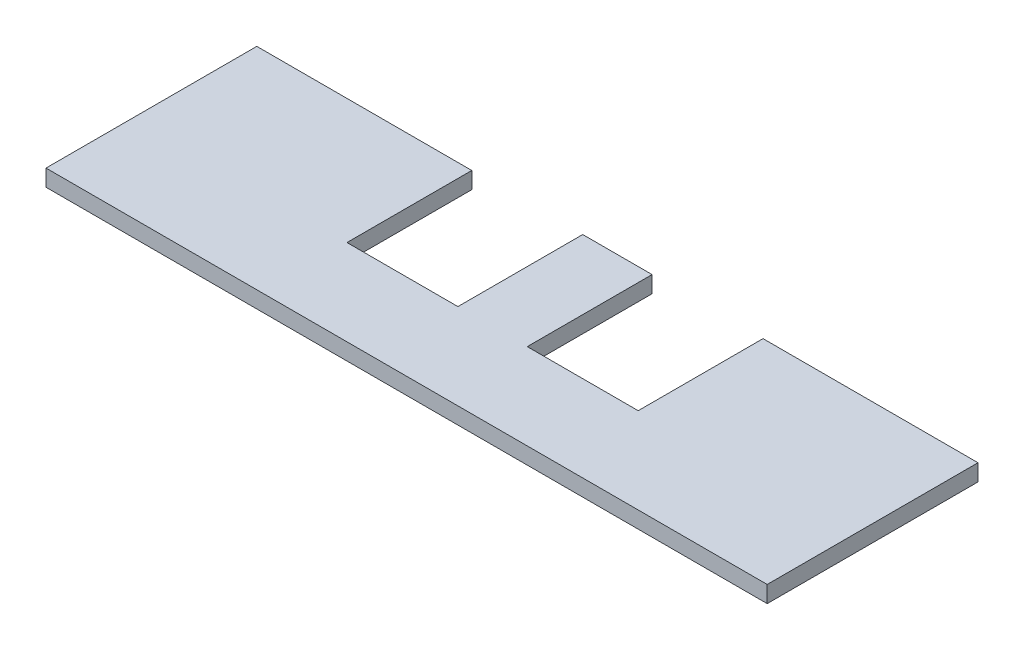
ISO-10303-21;
HEADER;
FILE_DESCRIPTION(('STEP AP214'),'2;1');
FILE_NAME('part.step','',(''),(''),'','','');
FILE_SCHEMA(('AUTOMOTIVE_DESIGN { 1 0 10303 214 1 1 1 1 }'));
ENDSEC;
DATA;
#1=APPLICATION_CONTEXT('core data for automotive mechanical design processes');
#2=APPLICATION_PROTOCOL_DEFINITION('international standard','automotive_design',2000,#1);
#3=PRODUCT_CONTEXT('',#1,'mechanical');
#4=PRODUCT('Part','Part','',(#3));
#5=PRODUCT_RELATED_PRODUCT_CATEGORY('part','',(#4));
#6=PRODUCT_DEFINITION_FORMATION('','',#4);
#7=PRODUCT_DEFINITION_CONTEXT('part definition',#1,'design');
#8=PRODUCT_DEFINITION('design','',#6,#7);
#9=PRODUCT_DEFINITION_SHAPE('','',#8);
#10=(LENGTH_UNIT() NAMED_UNIT(*) SI_UNIT(.MILLI.,.METRE.));
#11=(NAMED_UNIT(*) PLANE_ANGLE_UNIT() SI_UNIT($,.RADIAN.));
#12=(NAMED_UNIT(*) SI_UNIT($,.STERADIAN.) SOLID_ANGLE_UNIT());
#13=UNCERTAINTY_MEASURE_WITH_UNIT(LENGTH_MEASURE(1.E-05),#10,'distance_accuracy_value','');
#14=(GEOMETRIC_REPRESENTATION_CONTEXT(3) GLOBAL_UNCERTAINTY_ASSIGNED_CONTEXT((#13)) GLOBAL_UNIT_ASSIGNED_CONTEXT((#10,
#11,#12)) REPRESENTATION_CONTEXT('',''));
#15=CARTESIAN_POINT('',(0.,0.,0.));
#16=DIRECTION('',(0.,0.,1.));
#17=DIRECTION('',(1.,0.,0.));
#18=AXIS2_PLACEMENT_3D('',#15,#16,#17);
#19=CARTESIAN_POINT('',(0.,3.,0.));
#20=DIRECTION('',(0.,-1.,0.));
#21=DIRECTION('',(0.,0.,-1.));
#22=AXIS2_PLACEMENT_3D('',#19,#20,#21);
#23=PLANE('',#22);
#24=DIRECTION('',(0.,0.,-1.));
#25=VECTOR('',#24,1.);
#26=CARTESIAN_POINT('',(65.,3.,60.));
#27=LINE('',#26,#25);
#28=CARTESIAN_POINT('',(65.,3.,60.));
#29=VERTEX_POINT('',#28);
#30=CARTESIAN_POINT('',(65.,3.,22.));
#31=VERTEX_POINT('',#30);
#32=EDGE_CURVE('E146',#29,#31,#27,.T.);
#33=ORIENTED_EDGE('',*,*,#32,.T.);
#34=DIRECTION('',(-1.,0.,0.));
#35=VECTOR('',#34,1.);
#36=CARTESIAN_POINT('',(0.,3.,22.));
#37=LINE('',#36,#35);
#38=CARTESIAN_POINT('',(26.25,3.,22.));
#39=VERTEX_POINT('',#38);
#40=EDGE_CURVE('E213',#31,#39,#37,.T.);
#41=ORIENTED_EDGE('',*,*,#40,.T.);
#42=DIRECTION('',(0.,0.,-1.));
#43=VECTOR('',#42,1.);
#44=CARTESIAN_POINT('',(26.25,3.,0.));
#45=LINE('',#44,#43);
#46=CARTESIAN_POINT('',(26.25,3.,44.5));
#47=VERTEX_POINT('',#46);
#48=EDGE_CURVE('E189',#47,#39,#45,.T.);
#49=ORIENTED_EDGE('',*,*,#48,.F.);
#50=DIRECTION('',(1.,0.,0.));
#51=VECTOR('',#50,1.);
#52=CARTESIAN_POINT('',(0.,3.,44.5));
#53=LINE('',#52,#51);
#54=CARTESIAN_POINT('',(6.25,3.,44.5));
#55=VERTEX_POINT('',#54);
#56=EDGE_CURVE('E192',#55,#47,#53,.T.);
#57=ORIENTED_EDGE('',*,*,#56,.F.);
#58=DIRECTION('',(0.,0.,1.));
#59=VECTOR('',#58,1.);
#60=CARTESIAN_POINT('',(6.25,3.,0.));
#61=LINE('',#60,#59);
#62=CARTESIAN_POINT('',(6.25,3.,22.));
#63=VERTEX_POINT('',#62);
#64=EDGE_CURVE('E187',#63,#55,#61,.T.);
#65=ORIENTED_EDGE('',*,*,#64,.F.);
#66=CARTESIAN_POINT('',(-6.25,3.,22.));
#67=VERTEX_POINT('',#66);
#68=EDGE_CURVE('E56',#63,#67,#37,.T.);
#69=ORIENTED_EDGE('',*,*,#68,.T.);
#70=DIRECTION('',(0.,0.,1.));
#71=VECTOR('',#70,1.);
#72=CARTESIAN_POINT('',(-6.25,3.,0.));
#73=LINE('',#72,#71);
#74=CARTESIAN_POINT('',(-6.25,3.,44.5));
#75=VERTEX_POINT('',#74);
#76=EDGE_CURVE('E149',#67,#75,#73,.T.);
#77=ORIENTED_EDGE('',*,*,#76,.T.);
#78=DIRECTION('',(-1.,0.,0.));
#79=VECTOR('',#78,1.);
#80=CARTESIAN_POINT('',(0.,3.,44.5));
#81=LINE('',#80,#79);
#82=CARTESIAN_POINT('',(-26.25,3.,44.5));
#83=VERTEX_POINT('',#82);
#84=EDGE_CURVE('E167',#75,#83,#81,.T.);
#85=ORIENTED_EDGE('',*,*,#84,.T.);
#86=DIRECTION('',(0.,0.,-1.));
#87=VECTOR('',#86,1.);
#88=CARTESIAN_POINT('',(-26.25,3.,0.));
#89=LINE('',#88,#87);
#90=CARTESIAN_POINT('',(-26.25,3.,22.));
#91=VERTEX_POINT('',#90);
#92=EDGE_CURVE('E170',#83,#91,#89,.T.);
#93=ORIENTED_EDGE('',*,*,#92,.T.);
#94=CARTESIAN_POINT('',(-65.,3.,22.));
#95=VERTEX_POINT('',#94);
#96=EDGE_CURVE('E48',#91,#95,#37,.T.);
#97=ORIENTED_EDGE('',*,*,#96,.T.);
#98=DIRECTION('',(0.,0.,1.));
#99=VECTOR('',#98,1.);
#100=CARTESIAN_POINT('',(-65.,3.,60.));
#101=LINE('',#100,#99);
#102=CARTESIAN_POINT('',(-65.,3.,60.));
#103=VERTEX_POINT('',#102);
#104=EDGE_CURVE('E136',#95,#103,#101,.T.);
#105=ORIENTED_EDGE('',*,*,#104,.T.);
#106=DIRECTION('',(1.,0.,0.));
#107=VECTOR('',#106,1.);
#108=CARTESIAN_POINT('',(-65.,3.,60.));
#109=LINE('',#108,#107);
#110=EDGE_CURVE('E155',#103,#29,#109,.T.);
#111=ORIENTED_EDGE('',*,*,#110,.T.);
#112=EDGE_LOOP('',(#33,#41,#49,#57,#65,#69,#77,#85,#93,#97,#105,#111));
#113=FACE_BOUND('',#112,.T.);
#114=ADVANCED_FACE('F33',(#113),#23,.F.);
#115=CARTESIAN_POINT('',(0.,0.,0.));
#116=DIRECTION('',(0.,-1.,0.));
#117=DIRECTION('',(0.,0.,-1.));
#118=AXIS2_PLACEMENT_3D('',#115,#116,#117);
#119=PLANE('',#118);
#120=DIRECTION('',(1.,0.,0.));
#121=VECTOR('',#120,1.);
#122=CARTESIAN_POINT('',(-65.,0.,22.));
#123=LINE('',#122,#121);
#124=CARTESIAN_POINT('',(26.25,0.,22.));
#125=VERTEX_POINT('',#124);
#126=CARTESIAN_POINT('',(65.,0.,22.));
#127=VERTEX_POINT('',#126);
#128=EDGE_CURVE('E129',#125,#127,#123,.T.);
#129=ORIENTED_EDGE('',*,*,#128,.T.);
#130=DIRECTION('',(0.,0.,-1.));
#131=VECTOR('',#130,1.);
#132=CARTESIAN_POINT('',(65.,0.,60.));
#133=LINE('',#132,#131);
#134=CARTESIAN_POINT('',(65.,0.,60.));
#135=VERTEX_POINT('',#134);
#136=EDGE_CURVE('E144',#135,#127,#133,.T.);
#137=ORIENTED_EDGE('',*,*,#136,.F.);
#138=DIRECTION('',(1.,0.,0.));
#139=VECTOR('',#138,1.);
#140=CARTESIAN_POINT('',(-65.,0.,60.));
#141=LINE('',#140,#139);
#142=CARTESIAN_POINT('',(-65.,0.,60.));
#143=VERTEX_POINT('',#142);
#144=EDGE_CURVE('E143',#143,#135,#141,.T.);
#145=ORIENTED_EDGE('',*,*,#144,.F.);
#146=DIRECTION('',(0.,0.,1.));
#147=VECTOR('',#146,1.);
#148=CARTESIAN_POINT('',(-65.,0.,60.));
#149=LINE('',#148,#147);
#150=CARTESIAN_POINT('',(-65.,0.,22.));
#151=VERTEX_POINT('',#150);
#152=EDGE_CURVE('E134',#151,#143,#149,.T.);
#153=ORIENTED_EDGE('',*,*,#152,.F.);
#154=CARTESIAN_POINT('',(-26.25,0.,22.));
#155=VERTEX_POINT('',#154);
#156=EDGE_CURVE('E119',#151,#155,#123,.T.);
#157=ORIENTED_EDGE('',*,*,#156,.T.);
#158=DIRECTION('',(0.,0.,1.));
#159=VECTOR('',#158,1.);
#160=CARTESIAN_POINT('',(-26.25,0.,44.5));
#161=LINE('',#160,#159);
#162=CARTESIAN_POINT('',(-26.25,0.,44.5));
#163=VERTEX_POINT('',#162);
#164=EDGE_CURVE('E182',#155,#163,#161,.T.);
#165=ORIENTED_EDGE('',*,*,#164,.T.);
#166=DIRECTION('',(1.,0.,0.));
#167=VECTOR('',#166,1.);
#168=CARTESIAN_POINT('',(-26.25,0.,44.5));
#169=LINE('',#168,#167);
#170=CARTESIAN_POINT('',(-6.25,0.,44.5));
#171=VERTEX_POINT('',#170);
#172=EDGE_CURVE('E177',#163,#171,#169,.T.);
#173=ORIENTED_EDGE('',*,*,#172,.T.);
#174=DIRECTION('',(0.,0.,-1.));
#175=VECTOR('',#174,1.);
#176=CARTESIAN_POINT('',(-6.25,0.,44.5));
#177=LINE('',#176,#175);
#178=CARTESIAN_POINT('',(-6.25,0.,22.));
#179=VERTEX_POINT('',#178);
#180=EDGE_CURVE('E184',#171,#179,#177,.T.);
#181=ORIENTED_EDGE('',*,*,#180,.T.);
#182=CARTESIAN_POINT('',(6.25000000000001,0.,22.));
#183=VERTEX_POINT('',#182);
#184=EDGE_CURVE('E127',#179,#183,#123,.T.);
#185=ORIENTED_EDGE('',*,*,#184,.T.);
#186=DIRECTION('',(0.,0.,-1.));
#187=VECTOR('',#186,1.);
#188=CARTESIAN_POINT('',(6.25,0.,44.5));
#189=LINE('',#188,#187);
#190=CARTESIAN_POINT('',(6.25,0.,44.5));
#191=VERTEX_POINT('',#190);
#192=EDGE_CURVE('E204',#191,#183,#189,.T.);
#193=ORIENTED_EDGE('',*,*,#192,.F.);
#194=DIRECTION('',(-1.,0.,0.));
#195=VECTOR('',#194,1.);
#196=CARTESIAN_POINT('',(26.25,0.,44.5));
#197=LINE('',#196,#195);
#198=CARTESIAN_POINT('',(26.25,0.,44.5));
#199=VERTEX_POINT('',#198);
#200=EDGE_CURVE('E202',#199,#191,#197,.T.);
#201=ORIENTED_EDGE('',*,*,#200,.F.);
#202=DIRECTION('',(0.,0.,1.));
#203=VECTOR('',#202,1.);
#204=CARTESIAN_POINT('',(26.25,0.,44.5));
#205=LINE('',#204,#203);
#206=EDGE_CURVE('E198',#125,#199,#205,.T.);
#207=ORIENTED_EDGE('',*,*,#206,.F.);
#208=EDGE_LOOP('',(#129,#137,#145,#153,#157,#165,#173,#181,#185,#193,#201,#207));
#209=FACE_BOUND('',#208,.T.);
#210=ADVANCED_FACE('F141',(#209),#119,.T.);
#211=CARTESIAN_POINT('',(65.,3.,60.));
#212=DIRECTION('',(-1.,0.,0.));
#213=DIRECTION('',(0.,0.,1.));
#214=AXIS2_PLACEMENT_3D('',#211,#212,#213);
#215=PLANE('',#214);
#216=ORIENTED_EDGE('',*,*,#136,.T.);
#217=DIRECTION('',(0.,1.,0.));
#218=VECTOR('',#217,1.);
#219=CARTESIAN_POINT('',(65.,0.,22.));
#220=LINE('',#219,#218);
#221=EDGE_CURVE('E137',#127,#31,#220,.T.);
#222=ORIENTED_EDGE('',*,*,#221,.T.);
#223=ORIENTED_EDGE('',*,*,#32,.F.);
#224=DIRECTION('',(0.,-1.,0.));
#225=VECTOR('',#224,1.);
#226=CARTESIAN_POINT('',(65.,3.,60.));
#227=LINE('',#226,#225);
#228=EDGE_CURVE('E153',#29,#135,#227,.T.);
#229=ORIENTED_EDGE('',*,*,#228,.T.);
#230=EDGE_LOOP('',(#216,#222,#223,#229));
#231=FACE_BOUND('',#230,.T.);
#232=ADVANCED_FACE('F35',(#231),#215,.F.);
#233=CARTESIAN_POINT('',(-65.,3.,60.));
#234=DIRECTION('',(1.,0.,0.));
#235=DIRECTION('',(0.,0.,-1.));
#236=AXIS2_PLACEMENT_3D('',#233,#234,#235);
#237=PLANE('',#236);
#238=ORIENTED_EDGE('',*,*,#104,.F.);
#239=DIRECTION('',(0.,1.,0.));
#240=VECTOR('',#239,1.);
#241=CARTESIAN_POINT('',(-65.,0.,22.));
#242=LINE('',#241,#240);
#243=EDGE_CURVE('E122',#151,#95,#242,.T.);
#244=ORIENTED_EDGE('',*,*,#243,.F.);
#245=ORIENTED_EDGE('',*,*,#152,.T.);
#246=DIRECTION('',(0.,-1.,0.));
#247=VECTOR('',#246,1.);
#248=CARTESIAN_POINT('',(-65.,3.,60.));
#249=LINE('',#248,#247);
#250=EDGE_CURVE('E41',#103,#143,#249,.T.);
#251=ORIENTED_EDGE('',*,*,#250,.F.);
#252=EDGE_LOOP('',(#238,#244,#245,#251));
#253=FACE_BOUND('',#252,.T.);
#254=ADVANCED_FACE('F132',(#253),#237,.F.);
#255=CARTESIAN_POINT('',(-65.,3.,60.));
#256=DIRECTION('',(0.,0.,-1.));
#257=DIRECTION('',(-1.,0.,0.));
#258=AXIS2_PLACEMENT_3D('',#255,#256,#257);
#259=PLANE('',#258);
#260=ORIENTED_EDGE('',*,*,#144,.T.);
#261=ORIENTED_EDGE('',*,*,#228,.F.);
#262=ORIENTED_EDGE('',*,*,#110,.F.);
#263=ORIENTED_EDGE('',*,*,#250,.T.);
#264=EDGE_LOOP('',(#260,#261,#262,#263));
#265=FACE_BOUND('',#264,.T.);
#266=ADVANCED_FACE('F158',(#265),#259,.F.);
#267=CARTESIAN_POINT('',(-6.25,0.,44.5));
#268=DIRECTION('',(1.,0.,0.));
#269=DIRECTION('',(0.,0.,-1.));
#270=AXIS2_PLACEMENT_3D('',#267,#268,#269);
#271=PLANE('',#270);
#272=ORIENTED_EDGE('',*,*,#76,.F.);
#273=DIRECTION('',(0.,-1.,0.));
#274=VECTOR('',#273,1.);
#275=CARTESIAN_POINT('',(-6.25,0.,22.));
#276=LINE('',#275,#274);
#277=EDGE_CURVE('E208',#67,#179,#276,.T.);
#278=ORIENTED_EDGE('',*,*,#277,.T.);
#279=ORIENTED_EDGE('',*,*,#180,.F.);
#280=DIRECTION('',(0.,1.,0.));
#281=VECTOR('',#280,1.);
#282=CARTESIAN_POINT('',(-6.25,0.,44.5));
#283=LINE('',#282,#281);
#284=EDGE_CURVE('E173',#171,#75,#283,.T.);
#285=ORIENTED_EDGE('',*,*,#284,.T.);
#286=EDGE_LOOP('',(#272,#278,#279,#285));
#287=FACE_BOUND('',#286,.T.);
#288=ADVANCED_FACE('F238',(#287),#271,.F.);
#289=CARTESIAN_POINT('',(-26.25,0.,44.5));
#290=DIRECTION('',(0.,0.,1.));
#291=DIRECTION('',(1.,0.,0.));
#292=AXIS2_PLACEMENT_3D('',#289,#290,#291);
#293=PLANE('',#292);
#294=ORIENTED_EDGE('',*,*,#284,.F.);
#295=ORIENTED_EDGE('',*,*,#172,.F.);
#296=DIRECTION('',(0.,1.,0.));
#297=VECTOR('',#296,1.);
#298=CARTESIAN_POINT('',(-26.25,0.,44.5));
#299=LINE('',#298,#297);
#300=EDGE_CURVE('E174',#163,#83,#299,.T.);
#301=ORIENTED_EDGE('',*,*,#300,.T.);
#302=ORIENTED_EDGE('',*,*,#84,.F.);
#303=EDGE_LOOP('',(#294,#295,#301,#302));
#304=FACE_BOUND('',#303,.T.);
#305=ADVANCED_FACE('F242',(#304),#293,.F.);
#306=CARTESIAN_POINT('',(-26.25,0.,44.5));
#307=DIRECTION('',(-1.,0.,0.));
#308=DIRECTION('',(0.,0.,1.));
#309=AXIS2_PLACEMENT_3D('',#306,#307,#308);
#310=PLANE('',#309);
#311=ORIENTED_EDGE('',*,*,#164,.F.);
#312=DIRECTION('',(0.,1.,0.));
#313=VECTOR('',#312,1.);
#314=CARTESIAN_POINT('',(-26.25,0.,22.));
#315=LINE('',#314,#313);
#316=EDGE_CURVE('E123',#155,#91,#315,.T.);
#317=ORIENTED_EDGE('',*,*,#316,.T.);
#318=ORIENTED_EDGE('',*,*,#92,.F.);
#319=ORIENTED_EDGE('',*,*,#300,.F.);
#320=EDGE_LOOP('',(#311,#317,#318,#319));
#321=FACE_BOUND('',#320,.T.);
#322=ADVANCED_FACE('F245',(#321),#310,.F.);
#323=CARTESIAN_POINT('',(6.25,0.,44.5));
#324=DIRECTION('',(1.,0.,0.));
#325=DIRECTION('',(0.,0.,-1.));
#326=AXIS2_PLACEMENT_3D('',#323,#324,#325);
#327=PLANE('',#326);
#328=DIRECTION('',(0.,-1.,0.));
#329=VECTOR('',#328,1.);
#330=CARTESIAN_POINT('',(6.25,0.,22.));
#331=LINE('',#330,#329);
#332=EDGE_CURVE('E211',#63,#183,#331,.T.);
#333=ORIENTED_EDGE('',*,*,#332,.F.);
#334=ORIENTED_EDGE('',*,*,#64,.T.);
#335=DIRECTION('',(0.,1.,0.));
#336=VECTOR('',#335,1.);
#337=CARTESIAN_POINT('',(6.25,0.,44.5));
#338=LINE('',#337,#336);
#339=EDGE_CURVE('E195',#191,#55,#338,.T.);
#340=ORIENTED_EDGE('',*,*,#339,.F.);
#341=ORIENTED_EDGE('',*,*,#192,.T.);
#342=EDGE_LOOP('',(#333,#334,#340,#341));
#343=FACE_BOUND('',#342,.T.);
#344=ADVANCED_FACE('F233',(#343),#327,.T.);
#345=CARTESIAN_POINT('',(26.25,0.,44.5));
#346=DIRECTION('',(-1.,0.,0.));
#347=DIRECTION('',(0.,0.,1.));
#348=AXIS2_PLACEMENT_3D('',#345,#346,#347);
#349=PLANE('',#348);
#350=DIRECTION('',(0.,1.,0.));
#351=VECTOR('',#350,1.);
#352=CARTESIAN_POINT('',(26.25,0.,22.));
#353=LINE('',#352,#351);
#354=EDGE_CURVE('E11',#125,#39,#353,.T.);
#355=ORIENTED_EDGE('',*,*,#354,.F.);
#356=ORIENTED_EDGE('',*,*,#206,.T.);
#357=DIRECTION('',(0.,1.,0.));
#358=VECTOR('',#357,1.);
#359=CARTESIAN_POINT('',(26.25,0.,44.5));
#360=LINE('',#359,#358);
#361=EDGE_CURVE('E194',#199,#47,#360,.T.);
#362=ORIENTED_EDGE('',*,*,#361,.T.);
#363=ORIENTED_EDGE('',*,*,#48,.T.);
#364=EDGE_LOOP('',(#355,#356,#362,#363));
#365=FACE_BOUND('',#364,.T.);
#366=ADVANCED_FACE('F223',(#365),#349,.T.);
#367=CARTESIAN_POINT('',(26.25,0.,44.5));
#368=DIRECTION('',(0.,0.,-1.));
#369=DIRECTION('',(-1.,0.,0.));
#370=AXIS2_PLACEMENT_3D('',#367,#368,#369);
#371=PLANE('',#370);
#372=ORIENTED_EDGE('',*,*,#56,.T.);
#373=ORIENTED_EDGE('',*,*,#361,.F.);
#374=ORIENTED_EDGE('',*,*,#200,.T.);
#375=ORIENTED_EDGE('',*,*,#339,.T.);
#376=EDGE_LOOP('',(#372,#373,#374,#375));
#377=FACE_BOUND('',#376,.T.);
#378=ADVANCED_FACE('F228',(#377),#371,.T.);
#379=CARTESIAN_POINT('',(-65.,0.,22.));
#380=DIRECTION('',(0.,0.,1.));
#381=DIRECTION('',(1.,0.,0.));
#382=AXIS2_PLACEMENT_3D('',#379,#380,#381);
#383=PLANE('',#382);
#384=ORIENTED_EDGE('',*,*,#221,.F.);
#385=ORIENTED_EDGE('',*,*,#128,.F.);
#386=ORIENTED_EDGE('',*,*,#354,.T.);
#387=ORIENTED_EDGE('',*,*,#40,.F.);
#388=EDGE_LOOP('',(#384,#385,#386,#387));
#389=FACE_BOUND('',#388,.T.);
#390=ADVANCED_FACE('F301',(#389),#383,.F.);
#391=ORIENTED_EDGE('',*,*,#68,.F.);
#392=ORIENTED_EDGE('',*,*,#332,.T.);
#393=ORIENTED_EDGE('',*,*,#184,.F.);
#394=ORIENTED_EDGE('',*,*,#277,.F.);
#395=EDGE_LOOP('',(#391,#392,#393,#394));
#396=FACE_BOUND('',#395,.T.);
#397=ADVANCED_FACE('F310',(#396),#383,.F.);
#398=ORIENTED_EDGE('',*,*,#316,.F.);
#399=ORIENTED_EDGE('',*,*,#156,.F.);
#400=ORIENTED_EDGE('',*,*,#243,.T.);
#401=ORIENTED_EDGE('',*,*,#96,.F.);
#402=EDGE_LOOP('',(#398,#399,#400,#401));
#403=FACE_BOUND('',#402,.T.);
#404=ADVANCED_FACE('F121',(#403),#383,.F.);
#405=CLOSED_SHELL('',(#114,#210,#232,#254,#266,#288,#305,#322,#344,#366,#378,#390,#397,#404));
#406=MANIFOLD_SOLID_BREP('B2',#405);
#407=ADVANCED_BREP_SHAPE_REPRESENTATION('',(#18,#406),#14);
#408=SHAPE_DEFINITION_REPRESENTATION(#9,#407);
ENDSEC;
END-ISO-10303-21;
